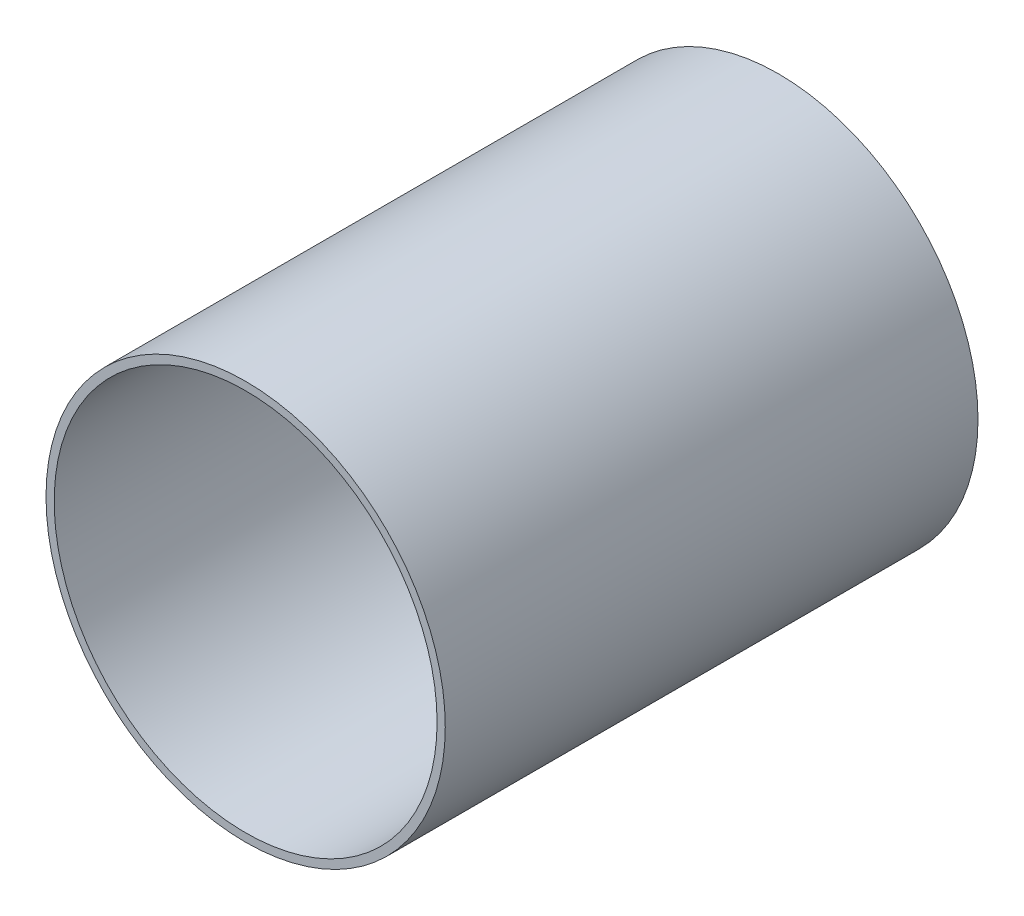
ISO-10303-21;
HEADER;
FILE_DESCRIPTION(('STEP AP214'),'2;1');
FILE_NAME('part.step','',(''),(''),'','','');
FILE_SCHEMA(('AUTOMOTIVE_DESIGN { 1 0 10303 214 1 1 1 1 }'));
ENDSEC;
DATA;
#1=APPLICATION_CONTEXT('core data for automotive mechanical design processes');
#2=APPLICATION_PROTOCOL_DEFINITION('international standard','automotive_design',2000,#1);
#3=PRODUCT_CONTEXT('',#1,'mechanical');
#4=PRODUCT('Part','Part','',(#3));
#5=PRODUCT_RELATED_PRODUCT_CATEGORY('part','',(#4));
#6=PRODUCT_DEFINITION_FORMATION('','',#4);
#7=PRODUCT_DEFINITION_CONTEXT('part definition',#1,'design');
#8=PRODUCT_DEFINITION('design','',#6,#7);
#9=PRODUCT_DEFINITION_SHAPE('','',#8);
#10=(LENGTH_UNIT() NAMED_UNIT(*) SI_UNIT(.MILLI.,.METRE.));
#11=(NAMED_UNIT(*) PLANE_ANGLE_UNIT() SI_UNIT($,.RADIAN.));
#12=(NAMED_UNIT(*) SI_UNIT($,.STERADIAN.) SOLID_ANGLE_UNIT());
#13=UNCERTAINTY_MEASURE_WITH_UNIT(LENGTH_MEASURE(1.E-05),#10,'distance_accuracy_value','');
#14=(GEOMETRIC_REPRESENTATION_CONTEXT(3) GLOBAL_UNCERTAINTY_ASSIGNED_CONTEXT((#13)) GLOBAL_UNIT_ASSIGNED_CONTEXT((#10,
#11,#12)) REPRESENTATION_CONTEXT('',''));
#15=CARTESIAN_POINT('',(0.,0.,0.));
#16=DIRECTION('',(0.,0.,1.));
#17=DIRECTION('',(1.,0.,0.));
#18=AXIS2_PLACEMENT_3D('',#15,#16,#17);
#19=CARTESIAN_POINT('',(0.,0.,50.8));
#20=DIRECTION('',(0.,0.,1.));
#21=DIRECTION('',(1.,0.,0.));
#22=AXIS2_PLACEMENT_3D('',#19,#20,#21);
#23=PLANE('',#22);
#24=CARTESIAN_POINT('',(0.,0.,50.8));
#25=DIRECTION('',(0.,0.,1.));
#26=DIRECTION('',(1.,0.,0.));
#27=AXIS2_PLACEMENT_3D('',#24,#25,#26);
#28=CIRCLE('',#27,38.0746);
#29=CARTESIAN_POINT('',(38.0746,0.,50.8));
#30=VERTEX_POINT('',#29);
#31=EDGE_CURVE('E10',#30,#30,#28,.T.);
#32=ORIENTED_EDGE('',*,*,#31,.T.);
#33=EDGE_LOOP('',(#32));
#34=FACE_BOUND('',#33,.T.);
#35=CARTESIAN_POINT('',(0.,0.,50.8));
#36=DIRECTION('',(0.,0.,1.));
#37=DIRECTION('',(1.,0.,0.));
#38=AXIS2_PLACEMENT_3D('',#35,#36,#37);
#39=CIRCLE('',#38,36.5125);
#40=CARTESIAN_POINT('',(36.5125,0.,50.8));
#41=VERTEX_POINT('',#40);
#42=EDGE_CURVE('E54',#41,#41,#39,.T.);
#43=ORIENTED_EDGE('',*,*,#42,.F.);
#44=EDGE_LOOP('',(#43));
#45=FACE_BOUND('',#44,.T.);
#46=ADVANCED_FACE('F43',(#34,#45),#23,.T.);
#47=CARTESIAN_POINT('',(0.,0.,-50.8));
#48=DIRECTION('',(0.,0.,1.));
#49=DIRECTION('',(1.,0.,0.));
#50=AXIS2_PLACEMENT_3D('',#47,#48,#49);
#51=PLANE('',#50);
#52=CARTESIAN_POINT('',(0.,0.,-50.8));
#53=DIRECTION('',(0.,0.,1.));
#54=DIRECTION('',(1.,0.,0.));
#55=AXIS2_PLACEMENT_3D('',#52,#53,#54);
#56=CIRCLE('',#55,38.0746);
#57=CARTESIAN_POINT('',(38.0746,0.,-50.8));
#58=VERTEX_POINT('',#57);
#59=EDGE_CURVE('E47',#58,#58,#56,.T.);
#60=ORIENTED_EDGE('',*,*,#59,.F.);
#61=EDGE_LOOP('',(#60));
#62=FACE_BOUND('',#61,.T.);
#63=CARTESIAN_POINT('',(0.,0.,-50.8));
#64=DIRECTION('',(0.,0.,1.));
#65=DIRECTION('',(1.,0.,0.));
#66=AXIS2_PLACEMENT_3D('',#63,#64,#65);
#67=CIRCLE('',#66,36.5125);
#68=CARTESIAN_POINT('',(36.5125,0.,-50.8));
#69=VERTEX_POINT('',#68);
#70=EDGE_CURVE('E56',#69,#69,#67,.T.);
#71=ORIENTED_EDGE('',*,*,#70,.T.);
#72=EDGE_LOOP('',(#71));
#73=FACE_BOUND('',#72,.T.);
#74=ADVANCED_FACE('F66',(#62,#73),#51,.F.);
#75=CARTESIAN_POINT('',(0.,0.,50.8));
#76=DIRECTION('',(0.,0.,-1.));
#77=DIRECTION('',(-1.,0.,0.));
#78=AXIS2_PLACEMENT_3D('',#75,#76,#77);
#79=CYLINDRICAL_SURFACE('',#78,38.0746);
#80=ORIENTED_EDGE('',*,*,#31,.F.);
#81=EDGE_LOOP('',(#80));
#82=FACE_BOUND('',#81,.T.);
#83=ORIENTED_EDGE('',*,*,#59,.T.);
#84=EDGE_LOOP('',(#83));
#85=FACE_BOUND('',#84,.T.);
#86=ADVANCED_FACE('F45',(#82,#85),#79,.T.);
#87=CARTESIAN_POINT('',(0.,0.,50.8));
#88=DIRECTION('',(0.,0.,-1.));
#89=DIRECTION('',(-1.,0.,0.));
#90=AXIS2_PLACEMENT_3D('',#87,#88,#89);
#91=CYLINDRICAL_SURFACE('',#90,36.5125);
#92=ORIENTED_EDGE('',*,*,#42,.T.);
#93=EDGE_LOOP('',(#92));
#94=FACE_BOUND('',#93,.T.);
#95=ORIENTED_EDGE('',*,*,#70,.F.);
#96=EDGE_LOOP('',(#95));
#97=FACE_BOUND('',#96,.T.);
#98=ADVANCED_FACE('F62',(#94,#97),#91,.F.);
#99=CLOSED_SHELL('',(#46,#74,#86,#98));
#100=MANIFOLD_SOLID_BREP('B2',#99);
#101=ADVANCED_BREP_SHAPE_REPRESENTATION('',(#18,#100),#14);
#102=SHAPE_DEFINITION_REPRESENTATION(#9,#101);
ENDSEC;
END-ISO-10303-21;
